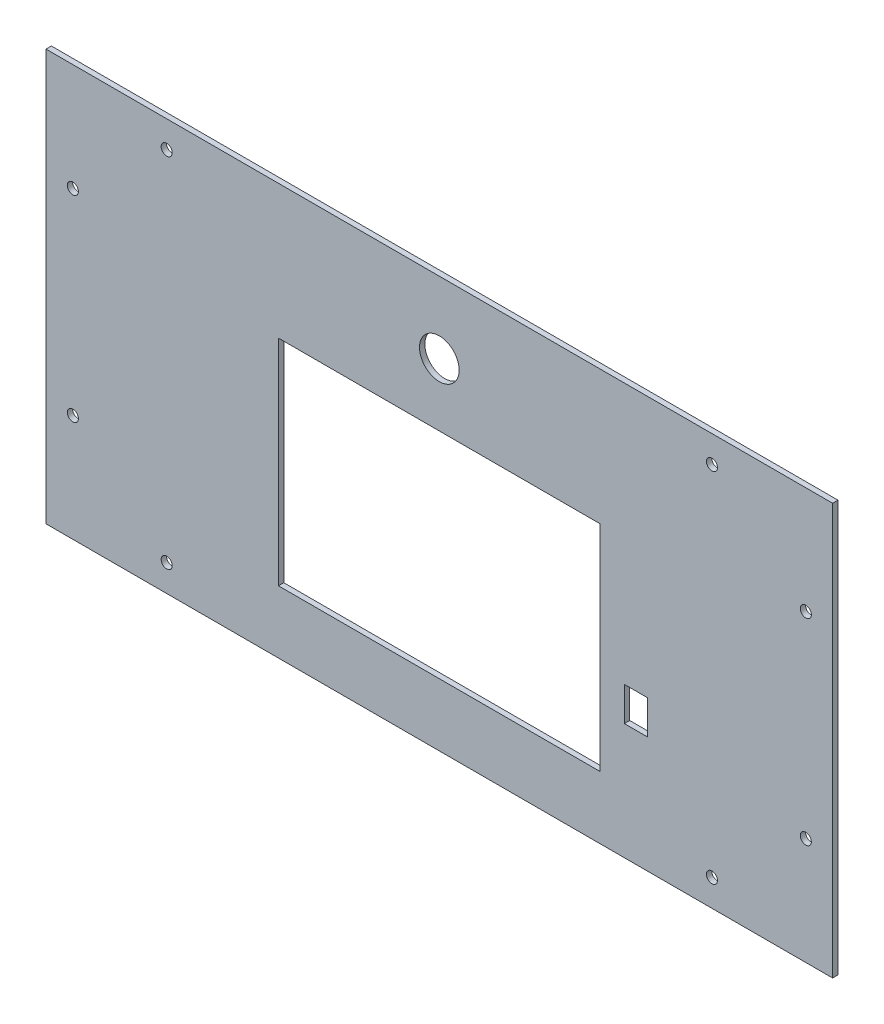
ISO-10303-21;
HEADER;
FILE_DESCRIPTION(('STEP AP214'),'2;1');
FILE_NAME('part.step','',(''),(''),'','','');
FILE_SCHEMA(('AUTOMOTIVE_DESIGN { 1 0 10303 214 1 1 1 1 }'));
ENDSEC;
DATA;
#1=APPLICATION_CONTEXT('core data for automotive mechanical design processes');
#2=APPLICATION_PROTOCOL_DEFINITION('international standard','automotive_design',2000,#1);
#3=PRODUCT_CONTEXT('',#1,'mechanical');
#4=PRODUCT('Part','Part','',(#3));
#5=PRODUCT_RELATED_PRODUCT_CATEGORY('part','',(#4));
#6=PRODUCT_DEFINITION_FORMATION('','',#4);
#7=PRODUCT_DEFINITION_CONTEXT('part definition',#1,'design');
#8=PRODUCT_DEFINITION('design','',#6,#7);
#9=PRODUCT_DEFINITION_SHAPE('','',#8);
#10=(LENGTH_UNIT() NAMED_UNIT(*) SI_UNIT(.MILLI.,.METRE.));
#11=(NAMED_UNIT(*) PLANE_ANGLE_UNIT() SI_UNIT($,.RADIAN.));
#12=(NAMED_UNIT(*) SI_UNIT($,.STERADIAN.) SOLID_ANGLE_UNIT());
#13=UNCERTAINTY_MEASURE_WITH_UNIT(LENGTH_MEASURE(1.E-05),#10,'distance_accuracy_value','');
#14=(GEOMETRIC_REPRESENTATION_CONTEXT(3) GLOBAL_UNCERTAINTY_ASSIGNED_CONTEXT((#13)) GLOBAL_UNIT_ASSIGNED_CONTEXT((#10,
#11,#12)) REPRESENTATION_CONTEXT('',''));
#15=CARTESIAN_POINT('',(0.,0.,0.));
#16=DIRECTION('',(0.,0.,1.));
#17=DIRECTION('',(1.,0.,0.));
#18=AXIS2_PLACEMENT_3D('',#15,#16,#17);
#19=CARTESIAN_POINT('',(220.,115.,3.));
#20=DIRECTION('',(-1.,0.,0.));
#21=DIRECTION('',(0.,0.,1.));
#22=AXIS2_PLACEMENT_3D('',#19,#20,#21);
#23=PLANE('',#22);
#24=DIRECTION('',(0.,1.,0.));
#25=VECTOR('',#24,1.);
#26=CARTESIAN_POINT('',(220.,115.,0.));
#27=LINE('',#26,#25);
#28=CARTESIAN_POINT('',(220.,-115.,0.));
#29=VERTEX_POINT('',#28);
#30=CARTESIAN_POINT('',(220.,115.,0.));
#31=VERTEX_POINT('',#30);
#32=EDGE_CURVE('E251',#29,#31,#27,.T.);
#33=ORIENTED_EDGE('',*,*,#32,.T.);
#34=DIRECTION('',(0.,0.,-1.));
#35=VECTOR('',#34,1.);
#36=CARTESIAN_POINT('',(220.,115.,3.));
#37=LINE('',#36,#35);
#38=CARTESIAN_POINT('',(220.,115.,3.));
#39=VERTEX_POINT('',#38);
#40=EDGE_CURVE('E12',#39,#31,#37,.T.);
#41=ORIENTED_EDGE('',*,*,#40,.F.);
#42=DIRECTION('',(0.,1.,0.));
#43=VECTOR('',#42,1.);
#44=CARTESIAN_POINT('',(220.,115.,3.));
#45=LINE('',#44,#43);
#46=CARTESIAN_POINT('',(220.,-115.,3.));
#47=VERTEX_POINT('',#46);
#48=EDGE_CURVE('E257',#47,#39,#45,.T.);
#49=ORIENTED_EDGE('',*,*,#48,.F.);
#50=DIRECTION('',(0.,0.,-1.));
#51=VECTOR('',#50,1.);
#52=CARTESIAN_POINT('',(220.,-115.,3.));
#53=LINE('',#52,#51);
#54=EDGE_CURVE('E274',#47,#29,#53,.T.);
#55=ORIENTED_EDGE('',*,*,#54,.T.);
#56=EDGE_LOOP('',(#33,#41,#49,#55));
#57=FACE_BOUND('',#56,.T.);
#58=ADVANCED_FACE('F41',(#57),#23,.F.);
#59=CARTESIAN_POINT('',(-220.,115.,3.));
#60=DIRECTION('',(0.,-1.,0.));
#61=DIRECTION('',(0.,0.,-1.));
#62=AXIS2_PLACEMENT_3D('',#59,#60,#61);
#63=PLANE('',#62);
#64=DIRECTION('',(-1.,0.,0.));
#65=VECTOR('',#64,1.);
#66=CARTESIAN_POINT('',(-220.,115.,0.));
#67=LINE('',#66,#65);
#68=CARTESIAN_POINT('',(-220.,115.,0.));
#69=VERTEX_POINT('',#68);
#70=EDGE_CURVE('E277',#31,#69,#67,.T.);
#71=ORIENTED_EDGE('',*,*,#70,.T.);
#72=DIRECTION('',(0.,0.,-1.));
#73=VECTOR('',#72,1.);
#74=CARTESIAN_POINT('',(-220.,115.,3.));
#75=LINE('',#74,#73);
#76=CARTESIAN_POINT('',(-220.,115.,3.));
#77=VERTEX_POINT('',#76);
#78=EDGE_CURVE('E48',#77,#69,#75,.T.);
#79=ORIENTED_EDGE('',*,*,#78,.F.);
#80=DIRECTION('',(-1.,0.,0.));
#81=VECTOR('',#80,1.);
#82=CARTESIAN_POINT('',(-220.,115.,3.));
#83=LINE('',#82,#81);
#84=EDGE_CURVE('E265',#39,#77,#83,.T.);
#85=ORIENTED_EDGE('',*,*,#84,.F.);
#86=ORIENTED_EDGE('',*,*,#40,.T.);
#87=EDGE_LOOP('',(#71,#79,#85,#86));
#88=FACE_BOUND('',#87,.T.);
#89=ADVANCED_FACE('F381',(#88),#63,.F.);
#90=CARTESIAN_POINT('',(-220.,115.,3.));
#91=DIRECTION('',(1.,0.,0.));
#92=DIRECTION('',(0.,1.,0.));
#93=AXIS2_PLACEMENT_3D('',#90,#91,#92);
#94=PLANE('',#93);
#95=DIRECTION('',(0.,-1.,0.));
#96=VECTOR('',#95,1.);
#97=CARTESIAN_POINT('',(-220.,115.,0.));
#98=LINE('',#97,#96);
#99=CARTESIAN_POINT('',(-220.,-115.,0.));
#100=VERTEX_POINT('',#99);
#101=EDGE_CURVE('E280',#69,#100,#98,.T.);
#102=ORIENTED_EDGE('',*,*,#101,.T.);
#103=DIRECTION('',(0.,0.,-1.));
#104=VECTOR('',#103,1.);
#105=CARTESIAN_POINT('',(-220.,-115.,3.));
#106=LINE('',#105,#104);
#107=CARTESIAN_POINT('',(-220.,-115.,3.));
#108=VERTEX_POINT('',#107);
#109=EDGE_CURVE('E288',#108,#100,#106,.T.);
#110=ORIENTED_EDGE('',*,*,#109,.F.);
#111=DIRECTION('',(0.,-1.,0.));
#112=VECTOR('',#111,1.);
#113=CARTESIAN_POINT('',(-220.,115.,3.));
#114=LINE('',#113,#112);
#115=EDGE_CURVE('E267',#77,#108,#114,.T.);
#116=ORIENTED_EDGE('',*,*,#115,.F.);
#117=ORIENTED_EDGE('',*,*,#78,.T.);
#118=EDGE_LOOP('',(#102,#110,#116,#117));
#119=FACE_BOUND('',#118,.T.);
#120=ADVANCED_FACE('F296',(#119),#94,.F.);
#121=CARTESIAN_POINT('',(-220.,-115.,3.));
#122=DIRECTION('',(0.,1.,0.));
#123=DIRECTION('',(0.,0.,1.));
#124=AXIS2_PLACEMENT_3D('',#121,#122,#123);
#125=PLANE('',#124);
#126=DIRECTION('',(1.,0.,0.));
#127=VECTOR('',#126,1.);
#128=CARTESIAN_POINT('',(-220.,-115.,0.));
#129=LINE('',#128,#127);
#130=EDGE_CURVE('E283',#100,#29,#129,.T.);
#131=ORIENTED_EDGE('',*,*,#130,.T.);
#132=ORIENTED_EDGE('',*,*,#54,.F.);
#133=DIRECTION('',(1.,0.,0.));
#134=VECTOR('',#133,1.);
#135=CARTESIAN_POINT('',(-220.,-115.,3.));
#136=LINE('',#135,#134);
#137=EDGE_CURVE('E270',#108,#47,#136,.T.);
#138=ORIENTED_EDGE('',*,*,#137,.F.);
#139=ORIENTED_EDGE('',*,*,#109,.T.);
#140=EDGE_LOOP('',(#131,#132,#138,#139));
#141=FACE_BOUND('',#140,.T.);
#142=ADVANCED_FACE('F305',(#141),#125,.F.);
#143=CARTESIAN_POINT('',(0.,0.,3.));
#144=DIRECTION('',(0.,0.,1.));
#145=DIRECTION('',(1.,0.,0.));
#146=AXIS2_PLACEMENT_3D('',#143,#144,#145);
#147=PLANE('',#146);
#148=DIRECTION('',(0.,1.,0.));
#149=VECTOR('',#148,1.);
#150=CARTESIAN_POINT('',(103.5,-31.,3.));
#151=LINE('',#150,#149);
#152=CARTESIAN_POINT('',(103.5,-50.,3.));
#153=VERTEX_POINT('',#152);
#154=CARTESIAN_POINT('',(103.5,-31.,3.));
#155=VERTEX_POINT('',#154);
#156=EDGE_CURVE('E136',#153,#155,#151,.T.);
#157=ORIENTED_EDGE('',*,*,#156,.T.);
#158=DIRECTION('',(1.,0.,0.));
#159=VECTOR('',#158,1.);
#160=CARTESIAN_POINT('',(116.5,-31.,3.));
#161=LINE('',#160,#159);
#162=CARTESIAN_POINT('',(116.5,-31.,3.));
#163=VERTEX_POINT('',#162);
#164=EDGE_CURVE('E146',#155,#163,#161,.T.);
#165=ORIENTED_EDGE('',*,*,#164,.T.);
#166=DIRECTION('',(0.,-1.,0.));
#167=VECTOR('',#166,1.);
#168=CARTESIAN_POINT('',(116.5,-31.,3.));
#169=LINE('',#168,#167);
#170=CARTESIAN_POINT('',(116.5,-50.,3.));
#171=VERTEX_POINT('',#170);
#172=EDGE_CURVE('E55',#163,#171,#169,.T.);
#173=ORIENTED_EDGE('',*,*,#172,.T.);
#174=DIRECTION('',(-1.,0.,0.));
#175=VECTOR('',#174,1.);
#176=CARTESIAN_POINT('',(116.5,-50.,3.));
#177=LINE('',#176,#175);
#178=EDGE_CURVE('E143',#171,#153,#177,.T.);
#179=ORIENTED_EDGE('',*,*,#178,.T.);
#180=EDGE_LOOP('',(#157,#165,#173,#179));
#181=FACE_BOUND('',#180,.T.);
#182=CARTESIAN_POINT('',(0.,75.,3.));
#183=DIRECTION('',(0.,0.,-1.));
#184=DIRECTION('',(-1.,0.,0.));
#185=AXIS2_PLACEMENT_3D('',#182,#183,#184);
#186=CIRCLE('',#185,11.1);
#187=CARTESIAN_POINT('',(-11.1,75.,3.));
#188=VERTEX_POINT('',#187);
#189=EDGE_CURVE('E184',#188,#188,#186,.T.);
#190=ORIENTED_EDGE('',*,*,#189,.T.);
#191=EDGE_LOOP('',(#190));
#192=FACE_BOUND('',#191,.T.);
#193=DIRECTION('',(0.,1.,0.));
#194=VECTOR('',#193,1.);
#195=CARTESIAN_POINT('',(-90.,40.,3.));
#196=LINE('',#195,#194);
#197=CARTESIAN_POINT('',(-90.,-80.,3.));
#198=VERTEX_POINT('',#197);
#199=CARTESIAN_POINT('',(-90.,40.,3.));
#200=VERTEX_POINT('',#199);
#201=EDGE_CURVE('E194',#198,#200,#196,.T.);
#202=ORIENTED_EDGE('',*,*,#201,.T.);
#203=DIRECTION('',(1.,0.,0.));
#204=VECTOR('',#203,1.);
#205=CARTESIAN_POINT('',(90.,40.,3.));
#206=LINE('',#205,#204);
#207=CARTESIAN_POINT('',(90.,40.,3.));
#208=VERTEX_POINT('',#207);
#209=EDGE_CURVE('E197',#200,#208,#206,.T.);
#210=ORIENTED_EDGE('',*,*,#209,.T.);
#211=DIRECTION('',(0.,-1.,0.));
#212=VECTOR('',#211,1.);
#213=CARTESIAN_POINT('',(90.,40.,3.));
#214=LINE('',#213,#212);
#215=CARTESIAN_POINT('',(90.,-80.,3.));
#216=VERTEX_POINT('',#215);
#217=EDGE_CURVE('E202',#208,#216,#214,.T.);
#218=ORIENTED_EDGE('',*,*,#217,.T.);
#219=DIRECTION('',(-1.,0.,0.));
#220=VECTOR('',#219,1.);
#221=CARTESIAN_POINT('',(90.,-80.,3.));
#222=LINE('',#221,#220);
#223=EDGE_CURVE('E207',#216,#198,#222,.T.);
#224=ORIENTED_EDGE('',*,*,#223,.T.);
#225=EDGE_LOOP('',(#202,#210,#218,#224));
#226=FACE_BOUND('',#225,.T.);
#227=CARTESIAN_POINT('',(-152.5,100.,3.));
#228=DIRECTION('',(0.,0.,1.));
#229=DIRECTION('',(1.,0.,0.));
#230=AXIS2_PLACEMENT_3D('',#227,#228,#229);
#231=CIRCLE('',#230,3.09999999999999);
#232=CARTESIAN_POINT('',(-149.4,100.,3.));
#233=VERTEX_POINT('',#232);
#234=EDGE_CURVE('E216',#233,#233,#231,.T.);
#235=ORIENTED_EDGE('',*,*,#234,.F.);
#236=EDGE_LOOP('',(#235));
#237=FACE_BOUND('',#236,.T.);
#238=CARTESIAN_POINT('',(152.5,100.,3.));
#239=DIRECTION('',(0.,0.,1.));
#240=DIRECTION('',(-1.,0.,0.));
#241=AXIS2_PLACEMENT_3D('',#238,#239,#240);
#242=CIRCLE('',#241,3.09999999999999);
#243=CARTESIAN_POINT('',(149.4,100.,3.));
#244=VERTEX_POINT('',#243);
#245=EDGE_CURVE('E226',#244,#244,#242,.T.);
#246=ORIENTED_EDGE('',*,*,#245,.F.);
#247=EDGE_LOOP('',(#246));
#248=FACE_BOUND('',#247,.T.);
#249=CARTESIAN_POINT('',(-205.,-55.0000000000368,3.));
#250=DIRECTION('',(0.,0.,1.));
#251=DIRECTION('',(-1.,0.,0.));
#252=AXIS2_PLACEMENT_3D('',#249,#250,#251);
#253=CIRCLE('',#252,3.09999999999999);
#254=CARTESIAN_POINT('',(-208.1,-55.0000000000368,3.));
#255=VERTEX_POINT('',#254);
#256=EDGE_CURVE('E233',#255,#255,#253,.T.);
#257=ORIENTED_EDGE('',*,*,#256,.F.);
#258=EDGE_LOOP('',(#257));
#259=FACE_BOUND('',#258,.T.);
#260=CARTESIAN_POINT('',(205.,-55.0000000000368,3.));
#261=DIRECTION('',(0.,0.,1.));
#262=DIRECTION('',(1.,0.,0.));
#263=AXIS2_PLACEMENT_3D('',#260,#261,#262);
#264=CIRCLE('',#263,3.09999999999999);
#265=CARTESIAN_POINT('',(208.1,-55.0000000000368,3.));
#266=VERTEX_POINT('',#265);
#267=EDGE_CURVE('E243',#266,#266,#264,.T.);
#268=ORIENTED_EDGE('',*,*,#267,.F.);
#269=EDGE_LOOP('',(#268));
#270=FACE_BOUND('',#269,.T.);
#271=CARTESIAN_POINT('',(205.,54.9999999999632,3.));
#272=DIRECTION('',(0.,0.,1.));
#273=DIRECTION('',(-1.,0.,0.));
#274=AXIS2_PLACEMENT_3D('',#271,#272,#273);
#275=CIRCLE('',#274,3.09999999999999);
#276=CARTESIAN_POINT('',(201.9,54.9999999999632,3.));
#277=VERTEX_POINT('',#276);
#278=EDGE_CURVE('E319',#277,#277,#275,.T.);
#279=ORIENTED_EDGE('',*,*,#278,.F.);
#280=EDGE_LOOP('',(#279));
#281=FACE_BOUND('',#280,.T.);
#282=CARTESIAN_POINT('',(152.5,-100.000000000073,3.));
#283=DIRECTION('',(0.,0.,1.));
#284=DIRECTION('',(1.,0.,0.));
#285=AXIS2_PLACEMENT_3D('',#282,#283,#284);
#286=CIRCLE('',#285,3.09999999999999);
#287=CARTESIAN_POINT('',(155.6,-100.000000000073,3.));
#288=VERTEX_POINT('',#287);
#289=EDGE_CURVE('E320',#288,#288,#286,.T.);
#290=ORIENTED_EDGE('',*,*,#289,.F.);
#291=EDGE_LOOP('',(#290));
#292=FACE_BOUND('',#291,.T.);
#293=CARTESIAN_POINT('',(-152.5,-100.000000000074,3.));
#294=DIRECTION('',(0.,0.,1.));
#295=DIRECTION('',(-1.,0.,0.));
#296=AXIS2_PLACEMENT_3D('',#293,#294,#295);
#297=CIRCLE('',#296,3.09999999999999);
#298=CARTESIAN_POINT('',(-155.6,-100.000000000074,3.));
#299=VERTEX_POINT('',#298);
#300=EDGE_CURVE('E328',#299,#299,#297,.T.);
#301=ORIENTED_EDGE('',*,*,#300,.F.);
#302=EDGE_LOOP('',(#301));
#303=FACE_BOUND('',#302,.T.);
#304=CARTESIAN_POINT('',(-205.,54.9999999999632,3.));
#305=DIRECTION('',(0.,0.,1.));
#306=DIRECTION('',(1.,0.,0.));
#307=AXIS2_PLACEMENT_3D('',#304,#305,#306);
#308=CIRCLE('',#307,3.09999999999999);
#309=CARTESIAN_POINT('',(-201.9,54.9999999999632,3.));
#310=VERTEX_POINT('',#309);
#311=EDGE_CURVE('E252',#310,#310,#308,.T.);
#312=ORIENTED_EDGE('',*,*,#311,.F.);
#313=EDGE_LOOP('',(#312));
#314=FACE_BOUND('',#313,.T.);
#315=ORIENTED_EDGE('',*,*,#48,.T.);
#316=ORIENTED_EDGE('',*,*,#84,.T.);
#317=ORIENTED_EDGE('',*,*,#115,.T.);
#318=ORIENTED_EDGE('',*,*,#137,.T.);
#319=EDGE_LOOP('',(#315,#316,#317,#318));
#320=FACE_BOUND('',#319,.T.);
#321=ADVANCED_FACE('F151',(#181,#192,#226,#237,#248,#259,#270,#281,#292,#303,#314,#320),#147,.T.);
#322=CARTESIAN_POINT('',(0.,0.,0.));
#323=DIRECTION('',(0.,0.,1.));
#324=DIRECTION('',(1.,0.,0.));
#325=AXIS2_PLACEMENT_3D('',#322,#323,#324);
#326=PLANE('',#325);
#327=DIRECTION('',(1.,0.,0.));
#328=VECTOR('',#327,1.);
#329=CARTESIAN_POINT('',(116.5,-31.,0.));
#330=LINE('',#329,#328);
#331=CARTESIAN_POINT('',(103.5,-31.,0.));
#332=VERTEX_POINT('',#331);
#333=CARTESIAN_POINT('',(116.5,-31.,0.));
#334=VERTEX_POINT('',#333);
#335=EDGE_CURVE('E174',#332,#334,#330,.T.);
#336=ORIENTED_EDGE('',*,*,#335,.F.);
#337=DIRECTION('',(0.,1.,0.));
#338=VECTOR('',#337,1.);
#339=CARTESIAN_POINT('',(103.5,-31.,0.));
#340=LINE('',#339,#338);
#341=CARTESIAN_POINT('',(103.5,-50.,0.));
#342=VERTEX_POINT('',#341);
#343=EDGE_CURVE('E63',#342,#332,#340,.T.);
#344=ORIENTED_EDGE('',*,*,#343,.F.);
#345=DIRECTION('',(-1.,0.,0.));
#346=VECTOR('',#345,1.);
#347=CARTESIAN_POINT('',(116.5,-50.,0.));
#348=LINE('',#347,#346);
#349=CARTESIAN_POINT('',(116.5,-50.,0.));
#350=VERTEX_POINT('',#349);
#351=EDGE_CURVE('E155',#350,#342,#348,.T.);
#352=ORIENTED_EDGE('',*,*,#351,.F.);
#353=DIRECTION('',(0.,-1.,0.));
#354=VECTOR('',#353,1.);
#355=CARTESIAN_POINT('',(116.5,-31.,0.));
#356=LINE('',#355,#354);
#357=EDGE_CURVE('E159',#334,#350,#356,.T.);
#358=ORIENTED_EDGE('',*,*,#357,.F.);
#359=EDGE_LOOP('',(#336,#344,#352,#358));
#360=FACE_BOUND('',#359,.T.);
#361=CARTESIAN_POINT('',(0.,75.,0.));
#362=DIRECTION('',(0.,0.,-1.));
#363=DIRECTION('',(-1.,0.,0.));
#364=AXIS2_PLACEMENT_3D('',#361,#362,#363);
#365=CIRCLE('',#364,11.1);
#366=CARTESIAN_POINT('',(-11.1,75.,0.));
#367=VERTEX_POINT('',#366);
#368=EDGE_CURVE('E180',#367,#367,#365,.T.);
#369=ORIENTED_EDGE('',*,*,#368,.F.);
#370=EDGE_LOOP('',(#369));
#371=FACE_BOUND('',#370,.T.);
#372=DIRECTION('',(1.,0.,0.));
#373=VECTOR('',#372,1.);
#374=CARTESIAN_POINT('',(90.,40.,0.));
#375=LINE('',#374,#373);
#376=CARTESIAN_POINT('',(-90.,40.,0.));
#377=VERTEX_POINT('',#376);
#378=CARTESIAN_POINT('',(90.,40.,0.));
#379=VERTEX_POINT('',#378);
#380=EDGE_CURVE('E587',#377,#379,#375,.T.);
#381=ORIENTED_EDGE('',*,*,#380,.F.);
#382=DIRECTION('',(0.,1.,0.));
#383=VECTOR('',#382,1.);
#384=CARTESIAN_POINT('',(-90.,40.,0.));
#385=LINE('',#384,#383);
#386=CARTESIAN_POINT('',(-90.,-80.,0.));
#387=VERTEX_POINT('',#386);
#388=EDGE_CURVE('E188',#387,#377,#385,.T.);
#389=ORIENTED_EDGE('',*,*,#388,.F.);
#390=DIRECTION('',(-1.,0.,0.));
#391=VECTOR('',#390,1.);
#392=CARTESIAN_POINT('',(90.,-80.,0.));
#393=LINE('',#392,#391);
#394=CARTESIAN_POINT('',(90.,-80.,0.));
#395=VERTEX_POINT('',#394);
#396=EDGE_CURVE('E198',#395,#387,#393,.T.);
#397=ORIENTED_EDGE('',*,*,#396,.F.);
#398=DIRECTION('',(0.,-1.,0.));
#399=VECTOR('',#398,1.);
#400=CARTESIAN_POINT('',(90.,40.,0.));
#401=LINE('',#400,#399);
#402=EDGE_CURVE('E615',#379,#395,#401,.T.);
#403=ORIENTED_EDGE('',*,*,#402,.F.);
#404=EDGE_LOOP('',(#381,#389,#397,#403));
#405=FACE_BOUND('',#404,.T.);
#406=CARTESIAN_POINT('',(-152.5,100.,0.));
#407=DIRECTION('',(0.,0.,1.));
#408=DIRECTION('',(1.,0.,0.));
#409=AXIS2_PLACEMENT_3D('',#406,#407,#408);
#410=CIRCLE('',#409,3.09999999999999);
#411=CARTESIAN_POINT('',(-149.4,100.,0.));
#412=VERTEX_POINT('',#411);
#413=EDGE_CURVE('E222',#412,#412,#410,.T.);
#414=ORIENTED_EDGE('',*,*,#413,.T.);
#415=EDGE_LOOP('',(#414));
#416=FACE_BOUND('',#415,.T.);
#417=CARTESIAN_POINT('',(152.5,100.,0.));
#418=DIRECTION('',(0.,0.,1.));
#419=DIRECTION('',(-1.,0.,0.));
#420=AXIS2_PLACEMENT_3D('',#417,#418,#419);
#421=CIRCLE('',#420,3.09999999999999);
#422=CARTESIAN_POINT('',(149.4,100.,0.));
#423=VERTEX_POINT('',#422);
#424=EDGE_CURVE('E223',#423,#423,#421,.T.);
#425=ORIENTED_EDGE('',*,*,#424,.T.);
#426=EDGE_LOOP('',(#425));
#427=FACE_BOUND('',#426,.T.);
#428=CARTESIAN_POINT('',(-205.,-55.0000000000368,0.));
#429=DIRECTION('',(0.,0.,1.));
#430=DIRECTION('',(-1.,0.,0.));
#431=AXIS2_PLACEMENT_3D('',#428,#429,#430);
#432=CIRCLE('',#431,3.09999999999999);
#433=CARTESIAN_POINT('',(-208.1,-55.0000000000368,0.));
#434=VERTEX_POINT('',#433);
#435=EDGE_CURVE('E230',#434,#434,#432,.T.);
#436=ORIENTED_EDGE('',*,*,#435,.T.);
#437=EDGE_LOOP('',(#436));
#438=FACE_BOUND('',#437,.T.);
#439=CARTESIAN_POINT('',(205.,-55.0000000000368,0.));
#440=DIRECTION('',(0.,0.,1.));
#441=DIRECTION('',(1.,0.,0.));
#442=AXIS2_PLACEMENT_3D('',#439,#440,#441);
#443=CIRCLE('',#442,3.09999999999999);
#444=CARTESIAN_POINT('',(208.1,-55.0000000000368,0.));
#445=VERTEX_POINT('',#444);
#446=EDGE_CURVE('E237',#445,#445,#443,.T.);
#447=ORIENTED_EDGE('',*,*,#446,.T.);
#448=EDGE_LOOP('',(#447));
#449=FACE_BOUND('',#448,.T.);
#450=CARTESIAN_POINT('',(205.,54.9999999999632,0.));
#451=DIRECTION('',(0.,0.,1.));
#452=DIRECTION('',(-1.,0.,0.));
#453=AXIS2_PLACEMENT_3D('',#450,#451,#452);
#454=CIRCLE('',#453,3.09999999999999);
#455=CARTESIAN_POINT('',(201.9,54.9999999999632,0.));
#456=VERTEX_POINT('',#455);
#457=EDGE_CURVE('E247',#456,#456,#454,.T.);
#458=ORIENTED_EDGE('',*,*,#457,.T.);
#459=EDGE_LOOP('',(#458));
#460=FACE_BOUND('',#459,.T.);
#461=CARTESIAN_POINT('',(152.5,-100.000000000073,0.));
#462=DIRECTION('',(0.,0.,1.));
#463=DIRECTION('',(1.,0.,0.));
#464=AXIS2_PLACEMENT_3D('',#461,#462,#463);
#465=CIRCLE('',#464,3.09999999999999);
#466=CARTESIAN_POINT('',(155.6,-100.000000000073,0.));
#467=VERTEX_POINT('',#466);
#468=EDGE_CURVE('E316',#467,#467,#465,.T.);
#469=ORIENTED_EDGE('',*,*,#468,.T.);
#470=EDGE_LOOP('',(#469));
#471=FACE_BOUND('',#470,.T.);
#472=CARTESIAN_POINT('',(-152.5,-100.000000000074,0.));
#473=DIRECTION('',(0.,0.,1.));
#474=DIRECTION('',(-1.,0.,0.));
#475=AXIS2_PLACEMENT_3D('',#472,#473,#474);
#476=CIRCLE('',#475,3.09999999999999);
#477=CARTESIAN_POINT('',(-155.6,-100.000000000074,0.));
#478=VERTEX_POINT('',#477);
#479=EDGE_CURVE('E323',#478,#478,#476,.T.);
#480=ORIENTED_EDGE('',*,*,#479,.T.);
#481=EDGE_LOOP('',(#480));
#482=FACE_BOUND('',#481,.T.);
#483=CARTESIAN_POINT('',(-205.,54.9999999999632,0.));
#484=DIRECTION('',(0.,0.,1.));
#485=DIRECTION('',(1.,0.,0.));
#486=AXIS2_PLACEMENT_3D('',#483,#484,#485);
#487=CIRCLE('',#486,3.09999999999999);
#488=CARTESIAN_POINT('',(-201.9,54.9999999999632,0.));
#489=VERTEX_POINT('',#488);
#490=EDGE_CURVE('E248',#489,#489,#487,.T.);
#491=ORIENTED_EDGE('',*,*,#490,.T.);
#492=EDGE_LOOP('',(#491));
#493=FACE_BOUND('',#492,.T.);
#494=ORIENTED_EDGE('',*,*,#32,.F.);
#495=ORIENTED_EDGE('',*,*,#130,.F.);
#496=ORIENTED_EDGE('',*,*,#101,.F.);
#497=ORIENTED_EDGE('',*,*,#70,.F.);
#498=EDGE_LOOP('',(#494,#495,#496,#497));
#499=FACE_BOUND('',#498,.T.);
#500=ADVANCED_FACE('F302',(#360,#371,#405,#416,#427,#438,#449,#460,#471,#482,#493,#499),#326,.F.);
#501=CARTESIAN_POINT('',(-205.,54.9999999999632,0.));
#502=DIRECTION('',(0.,0.,1.));
#503=DIRECTION('',(1.,0.,0.));
#504=AXIS2_PLACEMENT_3D('',#501,#502,#503);
#505=CYLINDRICAL_SURFACE('',#504,3.09999999999999);
#506=ORIENTED_EDGE('',*,*,#490,.F.);
#507=EDGE_LOOP('',(#506));
#508=FACE_BOUND('',#507,.T.);
#509=ORIENTED_EDGE('',*,*,#311,.T.);
#510=EDGE_LOOP('',(#509));
#511=FACE_BOUND('',#510,.T.);
#512=ADVANCED_FACE('F364',(#508,#511),#505,.F.);
#513=CARTESIAN_POINT('',(-152.5,-100.000000000074,0.));
#514=DIRECTION('',(0.,0.,1.));
#515=DIRECTION('',(1.,0.,0.));
#516=AXIS2_PLACEMENT_3D('',#513,#514,#515);
#517=CYLINDRICAL_SURFACE('',#516,3.09999999999999);
#518=ORIENTED_EDGE('',*,*,#479,.F.);
#519=EDGE_LOOP('',(#518));
#520=FACE_BOUND('',#519,.T.);
#521=ORIENTED_EDGE('',*,*,#300,.T.);
#522=EDGE_LOOP('',(#521));
#523=FACE_BOUND('',#522,.T.);
#524=ADVANCED_FACE('F366',(#520,#523),#517,.F.);
#525=CARTESIAN_POINT('',(152.5,-100.000000000073,0.));
#526=DIRECTION('',(0.,0.,1.));
#527=DIRECTION('',(1.,0.,0.));
#528=AXIS2_PLACEMENT_3D('',#525,#526,#527);
#529=CYLINDRICAL_SURFACE('',#528,3.09999999999999);
#530=ORIENTED_EDGE('',*,*,#468,.F.);
#531=EDGE_LOOP('',(#530));
#532=FACE_BOUND('',#531,.T.);
#533=ORIENTED_EDGE('',*,*,#289,.T.);
#534=EDGE_LOOP('',(#533));
#535=FACE_BOUND('',#534,.T.);
#536=ADVANCED_FACE('F373',(#532,#535),#529,.F.);
#537=CARTESIAN_POINT('',(205.,54.9999999999632,0.));
#538=DIRECTION('',(0.,0.,1.));
#539=DIRECTION('',(1.,0.,0.));
#540=AXIS2_PLACEMENT_3D('',#537,#538,#539);
#541=CYLINDRICAL_SURFACE('',#540,3.09999999999999);
#542=ORIENTED_EDGE('',*,*,#457,.F.);
#543=EDGE_LOOP('',(#542));
#544=FACE_BOUND('',#543,.T.);
#545=ORIENTED_EDGE('',*,*,#278,.T.);
#546=EDGE_LOOP('',(#545));
#547=FACE_BOUND('',#546,.T.);
#548=ADVANCED_FACE('F355',(#544,#547),#541,.F.);
#549=CARTESIAN_POINT('',(205.,-55.0000000000368,0.));
#550=DIRECTION('',(0.,0.,1.));
#551=DIRECTION('',(1.,0.,0.));
#552=AXIS2_PLACEMENT_3D('',#549,#550,#551);
#553=CYLINDRICAL_SURFACE('',#552,3.09999999999999);
#554=ORIENTED_EDGE('',*,*,#446,.F.);
#555=EDGE_LOOP('',(#554));
#556=FACE_BOUND('',#555,.T.);
#557=ORIENTED_EDGE('',*,*,#267,.T.);
#558=EDGE_LOOP('',(#557));
#559=FACE_BOUND('',#558,.T.);
#560=ADVANCED_FACE('F445',(#556,#559),#553,.F.);
#561=CARTESIAN_POINT('',(-205.,-55.0000000000368,0.));
#562=DIRECTION('',(0.,0.,1.));
#563=DIRECTION('',(1.,0.,0.));
#564=AXIS2_PLACEMENT_3D('',#561,#562,#563);
#565=CYLINDRICAL_SURFACE('',#564,3.09999999999999);
#566=ORIENTED_EDGE('',*,*,#435,.F.);
#567=EDGE_LOOP('',(#566));
#568=FACE_BOUND('',#567,.T.);
#569=ORIENTED_EDGE('',*,*,#256,.T.);
#570=EDGE_LOOP('',(#569));
#571=FACE_BOUND('',#570,.T.);
#572=ADVANCED_FACE('F455',(#568,#571),#565,.F.);
#573=CARTESIAN_POINT('',(152.5,100.,0.));
#574=DIRECTION('',(0.,0.,1.));
#575=DIRECTION('',(1.,0.,0.));
#576=AXIS2_PLACEMENT_3D('',#573,#574,#575);
#577=CYLINDRICAL_SURFACE('',#576,3.09999999999999);
#578=ORIENTED_EDGE('',*,*,#424,.F.);
#579=EDGE_LOOP('',(#578));
#580=FACE_BOUND('',#579,.T.);
#581=ORIENTED_EDGE('',*,*,#245,.T.);
#582=EDGE_LOOP('',(#581));
#583=FACE_BOUND('',#582,.T.);
#584=ADVANCED_FACE('F464',(#580,#583),#577,.F.);
#585=CARTESIAN_POINT('',(-152.5,100.,0.));
#586=DIRECTION('',(0.,0.,1.));
#587=DIRECTION('',(1.,0.,0.));
#588=AXIS2_PLACEMENT_3D('',#585,#586,#587);
#589=CYLINDRICAL_SURFACE('',#588,3.09999999999999);
#590=ORIENTED_EDGE('',*,*,#413,.F.);
#591=EDGE_LOOP('',(#590));
#592=FACE_BOUND('',#591,.T.);
#593=ORIENTED_EDGE('',*,*,#234,.T.);
#594=EDGE_LOOP('',(#593));
#595=FACE_BOUND('',#594,.T.);
#596=ADVANCED_FACE('F474',(#592,#595),#589,.F.);
#597=CARTESIAN_POINT('',(-90.,40.,3.));
#598=DIRECTION('',(-1.,0.,0.));
#599=DIRECTION('',(0.,-1.,0.));
#600=AXIS2_PLACEMENT_3D('',#597,#598,#599);
#601=PLANE('',#600);
#602=ORIENTED_EDGE('',*,*,#388,.T.);
#603=DIRECTION('',(0.,0.,-1.));
#604=VECTOR('',#603,1.);
#605=CARTESIAN_POINT('',(-90.,40.,3.));
#606=LINE('',#605,#604);
#607=EDGE_CURVE('E347',#200,#377,#606,.T.);
#608=ORIENTED_EDGE('',*,*,#607,.F.);
#609=ORIENTED_EDGE('',*,*,#201,.F.);
#610=DIRECTION('',(0.,0.,-1.));
#611=VECTOR('',#610,1.);
#612=CARTESIAN_POINT('',(-90.,-80.,3.));
#613=LINE('',#612,#611);
#614=EDGE_CURVE('E333',#198,#387,#613,.T.);
#615=ORIENTED_EDGE('',*,*,#614,.T.);
#616=EDGE_LOOP('',(#602,#608,#609,#615));
#617=FACE_BOUND('',#616,.T.);
#618=ADVANCED_FACE('F484',(#617),#601,.F.);
#619=CARTESIAN_POINT('',(90.,-80.,3.));
#620=DIRECTION('',(0.,-1.,0.));
#621=DIRECTION('',(0.,0.,-1.));
#622=AXIS2_PLACEMENT_3D('',#619,#620,#621);
#623=PLANE('',#622);
#624=ORIENTED_EDGE('',*,*,#396,.T.);
#625=ORIENTED_EDGE('',*,*,#614,.F.);
#626=ORIENTED_EDGE('',*,*,#223,.F.);
#627=DIRECTION('',(0.,0.,-1.));
#628=VECTOR('',#627,1.);
#629=CARTESIAN_POINT('',(90.,-80.,3.));
#630=LINE('',#629,#628);
#631=EDGE_CURVE('E336',#216,#395,#630,.T.);
#632=ORIENTED_EDGE('',*,*,#631,.T.);
#633=EDGE_LOOP('',(#624,#625,#626,#632));
#634=FACE_BOUND('',#633,.T.);
#635=ADVANCED_FACE('F494',(#634),#623,.F.);
#636=CARTESIAN_POINT('',(90.,40.,3.));
#637=DIRECTION('',(1.,0.,0.));
#638=DIRECTION('',(0.,1.,0.));
#639=AXIS2_PLACEMENT_3D('',#636,#637,#638);
#640=PLANE('',#639);
#641=ORIENTED_EDGE('',*,*,#402,.T.);
#642=ORIENTED_EDGE('',*,*,#631,.F.);
#643=ORIENTED_EDGE('',*,*,#217,.F.);
#644=DIRECTION('',(0.,0.,-1.));
#645=VECTOR('',#644,1.);
#646=CARTESIAN_POINT('',(90.,40.,3.));
#647=LINE('',#646,#645);
#648=EDGE_CURVE('E341',#208,#379,#647,.T.);
#649=ORIENTED_EDGE('',*,*,#648,.T.);
#650=EDGE_LOOP('',(#641,#642,#643,#649));
#651=FACE_BOUND('',#650,.T.);
#652=ADVANCED_FACE('F503',(#651),#640,.F.);
#653=CARTESIAN_POINT('',(90.,40.,3.));
#654=DIRECTION('',(0.,1.,0.));
#655=DIRECTION('',(0.,0.,1.));
#656=AXIS2_PLACEMENT_3D('',#653,#654,#655);
#657=PLANE('',#656);
#658=ORIENTED_EDGE('',*,*,#380,.T.);
#659=ORIENTED_EDGE('',*,*,#648,.F.);
#660=ORIENTED_EDGE('',*,*,#209,.F.);
#661=ORIENTED_EDGE('',*,*,#607,.T.);
#662=EDGE_LOOP('',(#658,#659,#660,#661));
#663=FACE_BOUND('',#662,.T.);
#664=ADVANCED_FACE('F513',(#663),#657,.F.);
#665=CARTESIAN_POINT('',(0.,75.,3.));
#666=DIRECTION('',(0.,0.,-1.));
#667=DIRECTION('',(-1.,0.,0.));
#668=AXIS2_PLACEMENT_3D('',#665,#666,#667);
#669=CYLINDRICAL_SURFACE('',#668,11.1);
#670=ORIENTED_EDGE('',*,*,#189,.F.);
#671=EDGE_LOOP('',(#670));
#672=FACE_BOUND('',#671,.T.);
#673=ORIENTED_EDGE('',*,*,#368,.T.);
#674=EDGE_LOOP('',(#673));
#675=FACE_BOUND('',#674,.T.);
#676=ADVANCED_FACE('F523',(#672,#675),#669,.F.);
#677=CARTESIAN_POINT('',(103.5,-31.,3.));
#678=DIRECTION('',(-1.,0.,0.));
#679=DIRECTION('',(0.,0.,1.));
#680=AXIS2_PLACEMENT_3D('',#677,#678,#679);
#681=PLANE('',#680);
#682=ORIENTED_EDGE('',*,*,#343,.T.);
#683=DIRECTION('',(0.,0.,-1.));
#684=VECTOR('',#683,1.);
#685=CARTESIAN_POINT('',(103.5,-31.,3.));
#686=LINE('',#685,#684);
#687=EDGE_CURVE('E132',#155,#332,#686,.T.);
#688=ORIENTED_EDGE('',*,*,#687,.F.);
#689=ORIENTED_EDGE('',*,*,#156,.F.);
#690=DIRECTION('',(0.,0.,-1.));
#691=VECTOR('',#690,1.);
#692=CARTESIAN_POINT('',(103.5,-50.,3.));
#693=LINE('',#692,#691);
#694=EDGE_CURVE('E178',#153,#342,#693,.T.);
#695=ORIENTED_EDGE('',*,*,#694,.T.);
#696=EDGE_LOOP('',(#682,#688,#689,#695));
#697=FACE_BOUND('',#696,.T.);
#698=ADVANCED_FACE('F134',(#697),#681,.F.);
#699=CARTESIAN_POINT('',(116.5,-50.,3.));
#700=DIRECTION('',(0.,-1.,0.));
#701=DIRECTION('',(0.,0.,-1.));
#702=AXIS2_PLACEMENT_3D('',#699,#700,#701);
#703=PLANE('',#702);
#704=ORIENTED_EDGE('',*,*,#351,.T.);
#705=ORIENTED_EDGE('',*,*,#694,.F.);
#706=ORIENTED_EDGE('',*,*,#178,.F.);
#707=DIRECTION('',(0.,0.,-1.));
#708=VECTOR('',#707,1.);
#709=CARTESIAN_POINT('',(116.5,-50.,3.));
#710=LINE('',#709,#708);
#711=EDGE_CURVE('E181',#171,#350,#710,.T.);
#712=ORIENTED_EDGE('',*,*,#711,.T.);
#713=EDGE_LOOP('',(#704,#705,#706,#712));
#714=FACE_BOUND('',#713,.T.);
#715=ADVANCED_FACE('F546',(#714),#703,.F.);
#716=CARTESIAN_POINT('',(116.5,-31.,3.));
#717=DIRECTION('',(1.,0.,0.));
#718=DIRECTION('',(0.,0.,-1.));
#719=AXIS2_PLACEMENT_3D('',#716,#717,#718);
#720=PLANE('',#719);
#721=ORIENTED_EDGE('',*,*,#357,.T.);
#722=ORIENTED_EDGE('',*,*,#711,.F.);
#723=ORIENTED_EDGE('',*,*,#172,.F.);
#724=DIRECTION('',(0.,0.,-1.));
#725=VECTOR('',#724,1.);
#726=CARTESIAN_POINT('',(116.5,-31.,3.));
#727=LINE('',#726,#725);
#728=EDGE_CURVE('E142',#163,#334,#727,.T.);
#729=ORIENTED_EDGE('',*,*,#728,.T.);
#730=EDGE_LOOP('',(#721,#722,#723,#729));
#731=FACE_BOUND('',#730,.T.);
#732=ADVANCED_FACE('F552',(#731),#720,.F.);
#733=CARTESIAN_POINT('',(116.5,-31.,3.));
#734=DIRECTION('',(0.,1.,0.));
#735=DIRECTION('',(-1.,0.,0.));
#736=AXIS2_PLACEMENT_3D('',#733,#734,#735);
#737=PLANE('',#736);
#738=ORIENTED_EDGE('',*,*,#335,.T.);
#739=ORIENTED_EDGE('',*,*,#728,.F.);
#740=ORIENTED_EDGE('',*,*,#164,.F.);
#741=ORIENTED_EDGE('',*,*,#687,.T.);
#742=EDGE_LOOP('',(#738,#739,#740,#741));
#743=FACE_BOUND('',#742,.T.);
#744=ADVANCED_FACE('F147',(#743),#737,.F.);
#745=CLOSED_SHELL('',(#58,#89,#120,#142,#321,#500,#512,#524,#536,#548,#560,#572,#584,#596,#618,
#635,#652,#664,#676,#698,#715,#732,#744));
#746=MANIFOLD_SOLID_BREP('B2',#745);
#747=ADVANCED_BREP_SHAPE_REPRESENTATION('',(#18,#746),#14);
#748=SHAPE_DEFINITION_REPRESENTATION(#9,#747);
ENDSEC;
END-ISO-10303-21;
